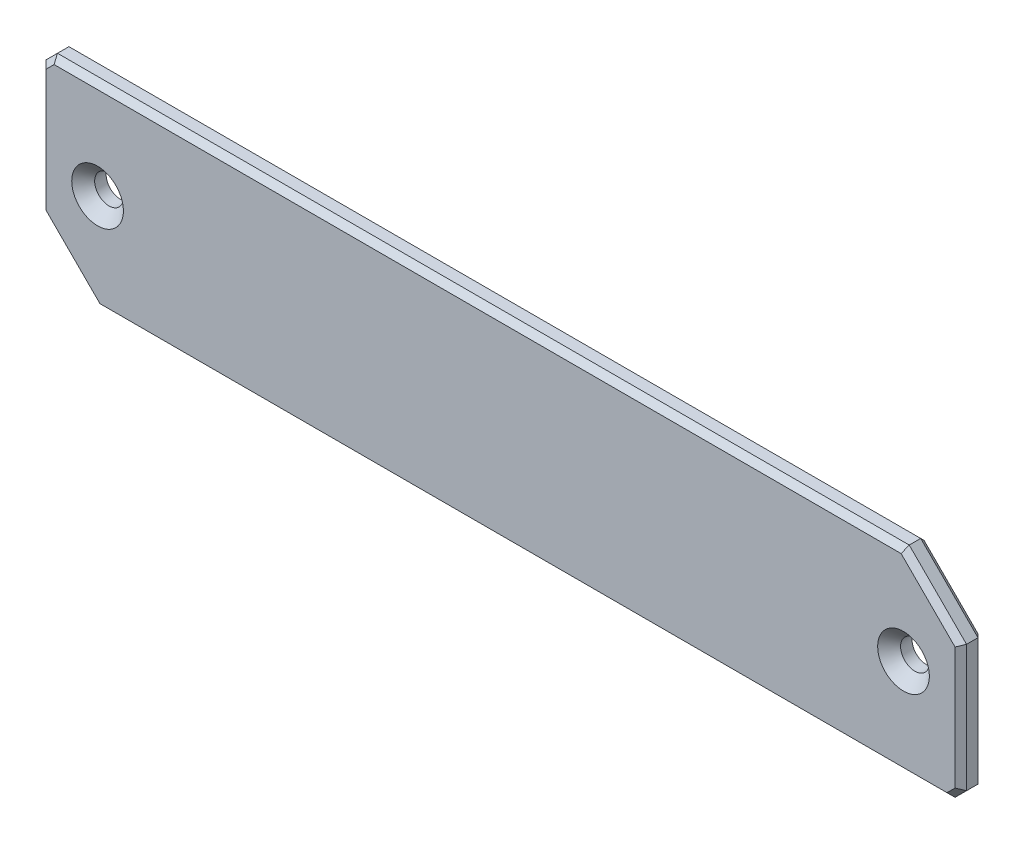
ISO-10303-21;
HEADER;
FILE_DESCRIPTION(('STEP AP214'),'2;1');
FILE_NAME('part.step','',(''),(''),'','','');
FILE_SCHEMA(('AUTOMOTIVE_DESIGN { 1 0 10303 214 1 1 1 1 }'));
ENDSEC;
DATA;
#1=APPLICATION_CONTEXT('core data for automotive mechanical design processes');
#2=APPLICATION_PROTOCOL_DEFINITION('international standard','automotive_design',2000,#1);
#3=PRODUCT_CONTEXT('',#1,'mechanical');
#4=PRODUCT('Part','Part','',(#3));
#5=PRODUCT_RELATED_PRODUCT_CATEGORY('part','',(#4));
#6=PRODUCT_DEFINITION_FORMATION('','',#4);
#7=PRODUCT_DEFINITION_CONTEXT('part definition',#1,'design');
#8=PRODUCT_DEFINITION('design','',#6,#7);
#9=PRODUCT_DEFINITION_SHAPE('','',#8);
#10=(LENGTH_UNIT() NAMED_UNIT(*) SI_UNIT(.MILLI.,.METRE.));
#11=(NAMED_UNIT(*) PLANE_ANGLE_UNIT() SI_UNIT($,.RADIAN.));
#12=(NAMED_UNIT(*) SI_UNIT($,.STERADIAN.) SOLID_ANGLE_UNIT());
#13=UNCERTAINTY_MEASURE_WITH_UNIT(LENGTH_MEASURE(1.E-05),#10,'distance_accuracy_value','');
#14=(GEOMETRIC_REPRESENTATION_CONTEXT(3) GLOBAL_UNCERTAINTY_ASSIGNED_CONTEXT((#13)) GLOBAL_UNIT_ASSIGNED_CONTEXT((#10,
#11,#12)) REPRESENTATION_CONTEXT('',''));
#15=CARTESIAN_POINT('',(0.,0.,0.));
#16=DIRECTION('',(0.,0.,1.));
#17=DIRECTION('',(1.,0.,0.));
#18=AXIS2_PLACEMENT_3D('',#15,#16,#17);
#19=CARTESIAN_POINT('',(0.,0.,2.));
#20=DIRECTION('',(0.,0.,-1.));
#21=DIRECTION('',(-1.,0.,0.));
#22=AXIS2_PLACEMENT_3D('',#19,#20,#21);
#23=PLANE('',#22);
#24=DIRECTION('',(-1.,0.,0.));
#25=VECTOR('',#24,1.);
#26=CARTESIAN_POINT('',(0.,18.3844434779468,2.));
#27=LINE('',#26,#25);
#28=CARTESIAN_POINT('',(9.24716234936022,18.3844434779468,2.));
#29=VERTEX_POINT('',#28);
#30=CARTESIAN_POINT('',(-64.6527720981398,18.3844434779468,2.));
#31=VERTEX_POINT('',#30);
#32=EDGE_CURVE('E160',#29,#31,#27,.T.);
#33=ORIENTED_EDGE('',*,*,#32,.T.);
#34=DIRECTION('',(-0.707106781186548,-0.707106781186548,0.));
#35=VECTOR('',#34,1.);
#36=CARTESIAN_POINT('',(-41.5186077880433,41.5186077880433,2.));
#37=LINE('',#36,#35);
#38=CARTESIAN_POINT('',(-65.3598788793264,17.6773366967603,2.));
#39=VERTEX_POINT('',#38);
#40=EDGE_CURVE('E191',#31,#39,#37,.T.);
#41=ORIENTED_EDGE('',*,*,#40,.T.);
#42=DIRECTION('',(0.,-1.,0.));
#43=VECTOR('',#42,1.);
#44=CARTESIAN_POINT('',(-65.3598788793264,0.,2.));
#45=LINE('',#44,#43);
#46=CARTESIAN_POINT('',(-65.3598788793264,7.02479380703534,2.));
#47=VERTEX_POINT('',#46);
#48=EDGE_CURVE('E189',#39,#47,#45,.T.);
#49=ORIENTED_EDGE('',*,*,#48,.T.);
#50=DIRECTION('',(0.707106781186547,-0.707106781186548,0.));
#51=VECTOR('',#50,1.);
#52=CARTESIAN_POINT('',(-29.1675425361455,-29.1675425361455,2.));
#53=LINE('',#52,#51);
#54=CARTESIAN_POINT('',(-60.6527720981398,2.31768702584879,2.));
#55=VERTEX_POINT('',#54);
#56=EDGE_CURVE('E187',#47,#55,#53,.T.);
#57=ORIENTED_EDGE('',*,*,#56,.T.);
#58=DIRECTION('',(1.,0.,0.));
#59=VECTOR('',#58,1.);
#60=CARTESIAN_POINT('',(0.,2.31768702584879,2.));
#61=LINE('',#60,#59);
#62=CARTESIAN_POINT('',(13.2471623493602,2.31768702584879,2.));
#63=VERTEX_POINT('',#62);
#64=EDGE_CURVE('E185',#55,#63,#61,.T.);
#65=ORIENTED_EDGE('',*,*,#64,.T.);
#66=DIRECTION('',(0.707106781186547,0.707106781186548,0.));
#67=VECTOR('',#66,1.);
#68=CARTESIAN_POINT('',(5.46473766175571,-5.46473766175571,2.));
#69=LINE('',#68,#67);
#70=CARTESIAN_POINT('',(13.9542691305468,3.02479380703535,2.));
#71=VERTEX_POINT('',#70);
#72=EDGE_CURVE('E156',#63,#71,#69,.T.);
#73=ORIENTED_EDGE('',*,*,#72,.T.);
#74=DIRECTION('',(0.,1.,0.));
#75=VECTOR('',#74,1.);
#76=CARTESIAN_POINT('',(13.9542691305468,0.,2.));
#77=LINE('',#76,#75);
#78=CARTESIAN_POINT('',(13.9542691305468,13.6773366967603,2.));
#79=VERTEX_POINT('',#78);
#80=EDGE_CURVE('E149',#71,#79,#77,.T.);
#81=ORIENTED_EDGE('',*,*,#80,.T.);
#82=DIRECTION('',(-0.707106781186547,0.707106781186548,0.));
#83=VECTOR('',#82,1.);
#84=CARTESIAN_POINT('',(13.8158029136535,13.8158029136535,2.));
#85=LINE('',#84,#83);
#86=EDGE_CURVE('E153',#79,#29,#85,.T.);
#87=ORIENTED_EDGE('',*,*,#86,.T.);
#88=EDGE_LOOP('',(#33,#41,#49,#57,#65,#73,#81,#87));
#89=FACE_BOUND('',#88,.T.);
#90=CARTESIAN_POINT('',(9.45426913054676,10.3510652518978,2.));
#91=DIRECTION('',(0.,0.,-1.));
#92=DIRECTION('',(-1.,0.,0.));
#93=AXIS2_PLACEMENT_3D('',#90,#91,#92);
#94=CIRCLE('',#93,2.25490856265427);
#95=CARTESIAN_POINT('',(7.19936056789248,10.3510652518978,2.));
#96=VERTEX_POINT('',#95);
#97=EDGE_CURVE('E180',#96,#96,#94,.T.);
#98=ORIENTED_EDGE('',*,*,#97,.T.);
#99=EDGE_LOOP('',(#98));
#100=FACE_BOUND('',#99,.T.);
#101=CARTESIAN_POINT('',(-60.8598788793264,10.3510652518978,2.));
#102=DIRECTION('',(0.,0.,-1.));
#103=DIRECTION('',(-1.,0.,0.));
#104=AXIS2_PLACEMENT_3D('',#101,#102,#103);
#105=CIRCLE('',#104,2.25490856265426);
#106=CARTESIAN_POINT('',(-63.1147874419806,10.3510652518978,2.));
#107=VERTEX_POINT('',#106);
#108=EDGE_CURVE('E336',#107,#107,#105,.T.);
#109=ORIENTED_EDGE('',*,*,#108,.T.);
#110=EDGE_LOOP('',(#109));
#111=FACE_BOUND('',#110,.T.);
#112=ADVANCED_FACE('F35',(#89,#100,#111),#23,.F.);
#113=CARTESIAN_POINT('',(0.,0.,0.));
#114=DIRECTION('',(0.,0.,-1.));
#115=DIRECTION('',(-1.,0.,0.));
#116=AXIS2_PLACEMENT_3D('',#113,#114,#115);
#117=PLANE('',#116);
#118=DIRECTION('',(1.,0.,0.));
#119=VECTOR('',#118,1.);
#120=CARTESIAN_POINT('',(9.45426913054676,18.3844434779468,0.));
#121=LINE('',#120,#119);
#122=CARTESIAN_POINT('',(-64.6527720981398,18.3844434779468,0.));
#123=VERTEX_POINT('',#122);
#124=CARTESIAN_POINT('',(9.24716234936022,18.3844434779468,0.));
#125=VERTEX_POINT('',#124);
#126=EDGE_CURVE('E228',#123,#125,#121,.T.);
#127=ORIENTED_EDGE('',*,*,#126,.T.);
#128=DIRECTION('',(0.707106781186547,-0.707106781186548,0.));
#129=VECTOR('',#128,1.);
#130=CARTESIAN_POINT('',(14.1007157399535,13.5308900873536,0.));
#131=LINE('',#130,#129);
#132=CARTESIAN_POINT('',(13.9542691305468,13.6773366967603,0.));
#133=VERTEX_POINT('',#132);
#134=EDGE_CURVE('E242',#125,#133,#131,.T.);
#135=ORIENTED_EDGE('',*,*,#134,.T.);
#136=DIRECTION('',(0.,-1.,0.));
#137=VECTOR('',#136,1.);
#138=CARTESIAN_POINT('',(13.9542691305468,2.8176870258488,0.));
#139=LINE('',#138,#137);
#140=CARTESIAN_POINT('',(13.9542691305468,3.02479380703534,0.));
#141=VERTEX_POINT('',#140);
#142=EDGE_CURVE('E240',#133,#141,#139,.T.);
#143=ORIENTED_EDGE('',*,*,#142,.T.);
#144=DIRECTION('',(-0.707106781186547,-0.707106781186548,0.));
#145=VECTOR('',#144,1.);
#146=CARTESIAN_POINT('',(13.1007157399535,2.17124041644207,0.));
#147=LINE('',#146,#145);
#148=CARTESIAN_POINT('',(13.2471623493602,2.31768702584879,0.));
#149=VERTEX_POINT('',#148);
#150=EDGE_CURVE('E238',#141,#149,#147,.T.);
#151=ORIENTED_EDGE('',*,*,#150,.T.);
#152=DIRECTION('',(-1.,0.,0.));
#153=VECTOR('',#152,1.);
#154=CARTESIAN_POINT('',(-60.8598788793264,2.31768702584879,0.));
#155=LINE('',#154,#153);
#156=CARTESIAN_POINT('',(-60.6527720981398,2.31768702584879,0.));
#157=VERTEX_POINT('',#156);
#158=EDGE_CURVE('E236',#149,#157,#155,.T.);
#159=ORIENTED_EDGE('',*,*,#158,.T.);
#160=DIRECTION('',(-0.707106781186547,0.707106781186548,0.));
#161=VECTOR('',#160,1.);
#162=CARTESIAN_POINT('',(-65.5063254887331,7.17124041644207,0.));
#163=LINE('',#162,#161);
#164=CARTESIAN_POINT('',(-65.3598788793264,7.02479380703536,0.));
#165=VERTEX_POINT('',#164);
#166=EDGE_CURVE('E234',#157,#165,#163,.T.);
#167=ORIENTED_EDGE('',*,*,#166,.T.);
#168=DIRECTION('',(0.,1.,0.));
#169=VECTOR('',#168,1.);
#170=CARTESIAN_POINT('',(-65.3598788793264,17.8844434779468,0.));
#171=LINE('',#170,#169);
#172=CARTESIAN_POINT('',(-65.3598788793264,17.6773366967603,0.));
#173=VERTEX_POINT('',#172);
#174=EDGE_CURVE('E232',#165,#173,#171,.T.);
#175=ORIENTED_EDGE('',*,*,#174,.T.);
#176=DIRECTION('',(0.707106781186548,0.707106781186548,0.));
#177=VECTOR('',#176,1.);
#178=CARTESIAN_POINT('',(-64.5063254887331,18.5308900873536,0.));
#179=LINE('',#178,#177);
#180=EDGE_CURVE('E230',#173,#123,#179,.T.);
#181=ORIENTED_EDGE('',*,*,#180,.T.);
#182=EDGE_LOOP('',(#127,#135,#143,#151,#159,#167,#175,#181));
#183=FACE_BOUND('',#182,.T.);
#184=CARTESIAN_POINT('',(-60.8598788793264,10.3510652518978,0.));
#185=DIRECTION('',(0.,0.,1.));
#186=DIRECTION('',(1.,0.,0.));
#187=AXIS2_PLACEMENT_3D('',#184,#185,#186);
#188=CIRCLE('',#187,1.25490856265426);
#189=CARTESIAN_POINT('',(-59.6049703166721,10.3510652518978,0.));
#190=VERTEX_POINT('',#189);
#191=EDGE_CURVE('E317',#190,#190,#188,.T.);
#192=ORIENTED_EDGE('',*,*,#191,.T.);
#193=EDGE_LOOP('',(#192));
#194=FACE_BOUND('',#193,.T.);
#195=CARTESIAN_POINT('',(9.45426913054676,10.3510652518978,0.));
#196=DIRECTION('',(0.,0.,1.));
#197=DIRECTION('',(1.,0.,0.));
#198=AXIS2_PLACEMENT_3D('',#195,#196,#197);
#199=CIRCLE('',#198,1.25490856265427);
#200=CARTESIAN_POINT('',(10.709177693201,10.3510652518978,0.));
#201=VERTEX_POINT('',#200);
#202=EDGE_CURVE('E225',#201,#201,#199,.T.);
#203=ORIENTED_EDGE('',*,*,#202,.T.);
#204=EDGE_LOOP('',(#203));
#205=FACE_BOUND('',#204,.T.);
#206=ADVANCED_FACE('F288',(#183,#194,#205),#117,.T.);
#207=CARTESIAN_POINT('',(-64.8598788793264,18.8844434779468,2.));
#208=DIRECTION('',(0.,-1.,0.));
#209=DIRECTION('',(0.,0.,-1.));
#210=AXIS2_PLACEMENT_3D('',#207,#208,#209);
#211=PLANE('',#210);
#212=DIRECTION('',(0.,0.,-1.));
#213=VECTOR('',#212,1.);
#214=CARTESIAN_POINT('',(9.45426913054676,18.8844434779468,2.));
#215=LINE('',#214,#213);
#216=CARTESIAN_POINT('',(9.45426913054676,18.8844434779468,1.5));
#217=VERTEX_POINT('',#216);
#218=CARTESIAN_POINT('',(9.45426913054676,18.8844434779468,0.499999999999994));
#219=VERTEX_POINT('',#218);
#220=EDGE_CURVE('E313',#217,#219,#215,.T.);
#221=ORIENTED_EDGE('',*,*,#220,.T.);
#222=DIRECTION('',(-1.,0.,0.));
#223=VECTOR('',#222,1.);
#224=CARTESIAN_POINT('',(-64.8598788793264,18.8844434779468,0.499999999999994));
#225=LINE('',#224,#223);
#226=CARTESIAN_POINT('',(-64.8598788793264,18.8844434779468,0.499999999999994));
#227=VERTEX_POINT('',#226);
#228=EDGE_CURVE('E11',#219,#227,#225,.T.);
#229=ORIENTED_EDGE('',*,*,#228,.T.);
#230=DIRECTION('',(0.,0.,-1.));
#231=VECTOR('',#230,1.);
#232=CARTESIAN_POINT('',(-64.8598788793264,18.8844434779468,2.));
#233=LINE('',#232,#231);
#234=CARTESIAN_POINT('',(-64.8598788793264,18.8844434779468,1.5));
#235=VERTEX_POINT('',#234);
#236=EDGE_CURVE('E331',#235,#227,#233,.T.);
#237=ORIENTED_EDGE('',*,*,#236,.F.);
#238=DIRECTION('',(1.,0.,0.));
#239=VECTOR('',#238,1.);
#240=CARTESIAN_POINT('',(-64.8598788793264,18.8844434779468,1.5));
#241=LINE('',#240,#239);
#242=EDGE_CURVE('E206',#235,#217,#241,.T.);
#243=ORIENTED_EDGE('',*,*,#242,.T.);
#244=EDGE_LOOP('',(#221,#229,#237,#243));
#245=FACE_BOUND('',#244,.T.);
#246=ADVANCED_FACE('F373',(#245),#211,.F.);
#247=CARTESIAN_POINT('',(-65.8598788793264,17.8844434779468,2.));
#248=DIRECTION('',(0.707106781186547,-0.707106781186547,0.));
#249=DIRECTION('',(0.707106781186548,0.707106781186548,0.));
#250=AXIS2_PLACEMENT_3D('',#247,#248,#249);
#251=PLANE('',#250);
#252=ORIENTED_EDGE('',*,*,#236,.T.);
#253=DIRECTION('',(-0.707106781186548,-0.707106781186548,0.));
#254=VECTOR('',#253,1.);
#255=CARTESIAN_POINT('',(-65.8598788793264,17.8844434779468,0.499999999999993));
#256=LINE('',#255,#254);
#257=CARTESIAN_POINT('',(-65.8598788793264,17.8844434779468,0.499999999999994));
#258=VERTEX_POINT('',#257);
#259=EDGE_CURVE('E44',#227,#258,#256,.T.);
#260=ORIENTED_EDGE('',*,*,#259,.T.);
#261=DIRECTION('',(0.,0.,-1.));
#262=VECTOR('',#261,1.);
#263=CARTESIAN_POINT('',(-65.8598788793264,17.8844434779468,2.));
#264=LINE('',#263,#262);
#265=CARTESIAN_POINT('',(-65.8598788793264,17.8844434779468,1.5));
#266=VERTEX_POINT('',#265);
#267=EDGE_CURVE('E329',#266,#258,#264,.T.);
#268=ORIENTED_EDGE('',*,*,#267,.F.);
#269=DIRECTION('',(0.707106781186548,0.707106781186548,0.));
#270=VECTOR('',#269,1.);
#271=CARTESIAN_POINT('',(-65.8598788793264,17.8844434779468,1.5));
#272=LINE('',#271,#270);
#273=EDGE_CURVE('E194',#266,#235,#272,.T.);
#274=ORIENTED_EDGE('',*,*,#273,.T.);
#275=EDGE_LOOP('',(#252,#260,#268,#274));
#276=FACE_BOUND('',#275,.T.);
#277=ADVANCED_FACE('F393',(#276),#251,.F.);
#278=CARTESIAN_POINT('',(-65.8598788793264,17.8844434779468,2.));
#279=DIRECTION('',(1.,0.,0.));
#280=DIRECTION('',(0.,0.,-1.));
#281=AXIS2_PLACEMENT_3D('',#278,#279,#280);
#282=PLANE('',#281);
#283=ORIENTED_EDGE('',*,*,#267,.T.);
#284=DIRECTION('',(0.,-1.,0.));
#285=VECTOR('',#284,1.);
#286=CARTESIAN_POINT('',(-65.8598788793264,6.8176870258488,0.499999999999994));
#287=LINE('',#286,#285);
#288=CARTESIAN_POINT('',(-65.8598788793264,6.8176870258488,0.499999999999994));
#289=VERTEX_POINT('',#288);
#290=EDGE_CURVE('E253',#258,#289,#287,.T.);
#291=ORIENTED_EDGE('',*,*,#290,.T.);
#292=DIRECTION('',(0.,0.,-1.));
#293=VECTOR('',#292,1.);
#294=CARTESIAN_POINT('',(-65.8598788793264,6.8176870258488,2.));
#295=LINE('',#294,#293);
#296=CARTESIAN_POINT('',(-65.8598788793264,6.8176870258488,1.49999999999999));
#297=VERTEX_POINT('',#296);
#298=EDGE_CURVE('E326',#297,#289,#295,.T.);
#299=ORIENTED_EDGE('',*,*,#298,.F.);
#300=DIRECTION('',(0.,1.,0.));
#301=VECTOR('',#300,1.);
#302=CARTESIAN_POINT('',(-65.8598788793264,17.8844434779468,1.5));
#303=LINE('',#302,#301);
#304=EDGE_CURVE('E197',#297,#266,#303,.T.);
#305=ORIENTED_EDGE('',*,*,#304,.T.);
#306=EDGE_LOOP('',(#283,#291,#299,#305));
#307=FACE_BOUND('',#306,.T.);
#308=ADVANCED_FACE('F389',(#307),#282,.F.);
#309=CARTESIAN_POINT('',(-65.8598788793264,6.8176870258488,2.));
#310=DIRECTION('',(0.707106781186548,0.707106781186547,0.));
#311=DIRECTION('',(-0.707106781186547,0.707106781186548,0.));
#312=AXIS2_PLACEMENT_3D('',#309,#310,#311);
#313=PLANE('',#312);
#314=ORIENTED_EDGE('',*,*,#298,.T.);
#315=DIRECTION('',(0.707106781186547,-0.707106781186548,0.));
#316=VECTOR('',#315,1.);
#317=CARTESIAN_POINT('',(-60.8598788793264,1.8176870258488,0.499999999999994));
#318=LINE('',#317,#316);
#319=CARTESIAN_POINT('',(-60.8598788793264,1.8176870258488,0.499999999999994));
#320=VERTEX_POINT('',#319);
#321=EDGE_CURVE('E251',#289,#320,#318,.T.);
#322=ORIENTED_EDGE('',*,*,#321,.T.);
#323=DIRECTION('',(0.,0.,-1.));
#324=VECTOR('',#323,1.);
#325=CARTESIAN_POINT('',(-60.8598788793264,1.8176870258488,2.));
#326=LINE('',#325,#324);
#327=CARTESIAN_POINT('',(-60.8598788793264,1.8176870258488,1.5));
#328=VERTEX_POINT('',#327);
#329=EDGE_CURVE('E323',#328,#320,#326,.T.);
#330=ORIENTED_EDGE('',*,*,#329,.F.);
#331=DIRECTION('',(-0.707106781186547,0.707106781186548,0.));
#332=VECTOR('',#331,1.);
#333=CARTESIAN_POINT('',(-65.8598788793264,6.8176870258488,1.49999999999999));
#334=LINE('',#333,#332);
#335=EDGE_CURVE('E199',#328,#297,#334,.T.);
#336=ORIENTED_EDGE('',*,*,#335,.T.);
#337=EDGE_LOOP('',(#314,#322,#330,#336));
#338=FACE_BOUND('',#337,.T.);
#339=ADVANCED_FACE('F385',(#338),#313,.F.);
#340=CARTESIAN_POINT('',(-60.8598788793264,1.8176870258488,2.));
#341=DIRECTION('',(0.,1.,0.));
#342=DIRECTION('',(0.,0.,1.));
#343=AXIS2_PLACEMENT_3D('',#340,#341,#342);
#344=PLANE('',#343);
#345=ORIENTED_EDGE('',*,*,#329,.T.);
#346=DIRECTION('',(1.,0.,0.));
#347=VECTOR('',#346,1.);
#348=CARTESIAN_POINT('',(13.4542691305468,1.8176870258488,0.499999999999994));
#349=LINE('',#348,#347);
#350=CARTESIAN_POINT('',(13.4542691305468,1.8176870258488,0.499999999999994));
#351=VERTEX_POINT('',#350);
#352=EDGE_CURVE('E249',#320,#351,#349,.T.);
#353=ORIENTED_EDGE('',*,*,#352,.T.);
#354=DIRECTION('',(0.,0.,-1.));
#355=VECTOR('',#354,1.);
#356=CARTESIAN_POINT('',(13.4542691305468,1.8176870258488,2.));
#357=LINE('',#356,#355);
#358=CARTESIAN_POINT('',(13.4542691305468,1.8176870258488,1.5));
#359=VERTEX_POINT('',#358);
#360=EDGE_CURVE('E315',#359,#351,#357,.T.);
#361=ORIENTED_EDGE('',*,*,#360,.F.);
#362=DIRECTION('',(-1.,0.,0.));
#363=VECTOR('',#362,1.);
#364=CARTESIAN_POINT('',(-60.8598788793264,1.8176870258488,1.5));
#365=LINE('',#364,#363);
#366=EDGE_CURVE('E201',#359,#328,#365,.T.);
#367=ORIENTED_EDGE('',*,*,#366,.T.);
#368=EDGE_LOOP('',(#345,#353,#361,#367));
#369=FACE_BOUND('',#368,.T.);
#370=ADVANCED_FACE('F381',(#369),#344,.F.);
#371=CARTESIAN_POINT('',(14.4542691305468,2.8176870258488,2.));
#372=DIRECTION('',(-0.707106781186548,0.707106781186547,0.));
#373=DIRECTION('',(-0.707106781186547,-0.707106781186548,0.));
#374=AXIS2_PLACEMENT_3D('',#371,#372,#373);
#375=PLANE('',#374);
#376=ORIENTED_EDGE('',*,*,#360,.T.);
#377=DIRECTION('',(0.707106781186547,0.707106781186548,0.));
#378=VECTOR('',#377,1.);
#379=CARTESIAN_POINT('',(14.4542691305468,2.8176870258488,0.499999999999994));
#380=LINE('',#379,#378);
#381=CARTESIAN_POINT('',(14.4542691305468,2.8176870258488,0.499999999999994));
#382=VERTEX_POINT('',#381);
#383=EDGE_CURVE('E247',#351,#382,#380,.T.);
#384=ORIENTED_EDGE('',*,*,#383,.T.);
#385=DIRECTION('',(0.,0.,-1.));
#386=VECTOR('',#385,1.);
#387=CARTESIAN_POINT('',(14.4542691305468,2.8176870258488,2.));
#388=LINE('',#387,#386);
#389=CARTESIAN_POINT('',(14.4542691305468,2.8176870258488,1.5));
#390=VERTEX_POINT('',#389);
#391=EDGE_CURVE('E309',#390,#382,#388,.T.);
#392=ORIENTED_EDGE('',*,*,#391,.F.);
#393=DIRECTION('',(-0.707106781186547,-0.707106781186548,0.));
#394=VECTOR('',#393,1.);
#395=CARTESIAN_POINT('',(14.4542691305468,2.8176870258488,1.5));
#396=LINE('',#395,#394);
#397=EDGE_CURVE('E203',#390,#359,#396,.T.);
#398=ORIENTED_EDGE('',*,*,#397,.T.);
#399=EDGE_LOOP('',(#376,#384,#392,#398));
#400=FACE_BOUND('',#399,.T.);
#401=ADVANCED_FACE('F378',(#400),#375,.F.);
#402=CARTESIAN_POINT('',(14.4542691305468,13.8844434779468,2.));
#403=DIRECTION('',(-1.,0.,0.));
#404=DIRECTION('',(0.,-1.,0.));
#405=AXIS2_PLACEMENT_3D('',#402,#403,#404);
#406=PLANE('',#405);
#407=ORIENTED_EDGE('',*,*,#391,.T.);
#408=DIRECTION('',(0.,1.,0.));
#409=VECTOR('',#408,1.);
#410=CARTESIAN_POINT('',(14.4542691305468,13.8844434779468,0.499999999999994));
#411=LINE('',#410,#409);
#412=CARTESIAN_POINT('',(14.4542691305468,13.8844434779468,0.499999999999994));
#413=VERTEX_POINT('',#412);
#414=EDGE_CURVE('E245',#382,#413,#411,.T.);
#415=ORIENTED_EDGE('',*,*,#414,.T.);
#416=DIRECTION('',(0.,0.,-1.));
#417=VECTOR('',#416,1.);
#418=CARTESIAN_POINT('',(14.4542691305468,13.8844434779468,2.));
#419=LINE('',#418,#417);
#420=CARTESIAN_POINT('',(14.4542691305468,13.8844434779468,1.5));
#421=VERTEX_POINT('',#420);
#422=EDGE_CURVE('E307',#421,#413,#419,.T.);
#423=ORIENTED_EDGE('',*,*,#422,.F.);
#424=DIRECTION('',(0.,-1.,0.));
#425=VECTOR('',#424,1.);
#426=CARTESIAN_POINT('',(14.4542691305468,13.8844434779468,1.5));
#427=LINE('',#426,#425);
#428=EDGE_CURVE('E166',#421,#390,#427,.T.);
#429=ORIENTED_EDGE('',*,*,#428,.T.);
#430=EDGE_LOOP('',(#407,#415,#423,#429));
#431=FACE_BOUND('',#430,.T.);
#432=ADVANCED_FACE('F306',(#431),#406,.F.);
#433=CARTESIAN_POINT('',(9.45426913054676,18.8844434779468,2.));
#434=DIRECTION('',(-0.707106781186548,-0.707106781186547,0.));
#435=DIRECTION('',(0.707106781186547,-0.707106781186548,0.));
#436=AXIS2_PLACEMENT_3D('',#433,#434,#435);
#437=PLANE('',#436);
#438=ORIENTED_EDGE('',*,*,#422,.T.);
#439=DIRECTION('',(-0.707106781186547,0.707106781186548,0.));
#440=VECTOR('',#439,1.);
#441=CARTESIAN_POINT('',(9.45426913054676,18.8844434779468,0.499999999999994));
#442=LINE('',#441,#440);
#443=EDGE_CURVE('E210',#413,#219,#442,.T.);
#444=ORIENTED_EDGE('',*,*,#443,.T.);
#445=ORIENTED_EDGE('',*,*,#220,.F.);
#446=DIRECTION('',(0.707106781186547,-0.707106781186548,0.));
#447=VECTOR('',#446,1.);
#448=CARTESIAN_POINT('',(9.45426913054676,18.8844434779468,1.5));
#449=LINE('',#448,#447);
#450=EDGE_CURVE('E208',#217,#421,#449,.T.);
#451=ORIENTED_EDGE('',*,*,#450,.T.);
#452=EDGE_LOOP('',(#438,#444,#445,#451));
#453=FACE_BOUND('',#452,.T.);
#454=ADVANCED_FACE('F311',(#453),#437,.F.);
#455=CARTESIAN_POINT('',(-60.8598788793264,10.3510652518978,2.));
#456=DIRECTION('',(0.,0.,-1.));
#457=DIRECTION('',(-1.,0.,0.));
#458=AXIS2_PLACEMENT_3D('',#455,#456,#457);
#459=CYLINDRICAL_SURFACE('',#458,1.25490856265426);
#460=CARTESIAN_POINT('',(-60.8598788793264,10.3510652518978,1.00000000000001));
#461=DIRECTION('',(0.,0.,-1.));
#462=DIRECTION('',(-1.,0.,0.));
#463=AXIS2_PLACEMENT_3D('',#460,#461,#462);
#464=CIRCLE('',#463,1.25490856265426);
#465=CARTESIAN_POINT('',(-62.1147874419806,10.3510652518978,1.00000000000001));
#466=VERTEX_POINT('',#465);
#467=EDGE_CURVE('E176',#466,#466,#464,.F.);
#468=ORIENTED_EDGE('',*,*,#467,.T.);
#469=EDGE_LOOP('',(#468));
#470=FACE_BOUND('',#469,.T.);
#471=ORIENTED_EDGE('',*,*,#191,.F.);
#472=EDGE_LOOP('',(#471));
#473=FACE_BOUND('',#472,.T.);
#474=ADVANCED_FACE('F352',(#470,#473),#459,.F.);
#475=CARTESIAN_POINT('',(9.45426913054676,10.3510652518978,2.));
#476=DIRECTION('',(0.,0.,-1.));
#477=DIRECTION('',(-1.,0.,0.));
#478=AXIS2_PLACEMENT_3D('',#475,#476,#477);
#479=CYLINDRICAL_SURFACE('',#478,1.25490856265427);
#480=CARTESIAN_POINT('',(9.45426913054676,10.3510652518978,1.));
#481=DIRECTION('',(0.,0.,-1.));
#482=DIRECTION('',(-1.,0.,0.));
#483=AXIS2_PLACEMENT_3D('',#480,#481,#482);
#484=CIRCLE('',#483,1.25490856265427);
#485=CARTESIAN_POINT('',(8.19936056789249,10.3510652518978,1.));
#486=VERTEX_POINT('',#485);
#487=EDGE_CURVE('E333',#486,#486,#484,.F.);
#488=ORIENTED_EDGE('',*,*,#487,.T.);
#489=EDGE_LOOP('',(#488));
#490=FACE_BOUND('',#489,.T.);
#491=ORIENTED_EDGE('',*,*,#202,.F.);
#492=EDGE_LOOP('',(#491));
#493=FACE_BOUND('',#492,.T.);
#494=ADVANCED_FACE('F346',(#490,#493),#479,.F.);
#495=CARTESIAN_POINT('',(9.45426913054676,10.3510652518978,1.));
#496=DIRECTION('',(0.,0.,1.));
#497=DIRECTION('',(1.,0.,0.));
#498=AXIS2_PLACEMENT_3D('',#495,#496,#497);
#499=CONICAL_SURFACE('',#498,1.25490856265427,0.785398163397449);
#500=ORIENTED_EDGE('',*,*,#97,.F.);
#501=EDGE_LOOP('',(#500));
#502=FACE_BOUND('',#501,.T.);
#503=ORIENTED_EDGE('',*,*,#487,.F.);
#504=EDGE_LOOP('',(#503));
#505=FACE_BOUND('',#504,.T.);
#506=ADVANCED_FACE('F342',(#502,#505),#499,.F.);
#507=CARTESIAN_POINT('',(-60.8598788793264,10.3510652518978,1.00000000000001));
#508=DIRECTION('',(0.,0.,1.));
#509=DIRECTION('',(1.,0.,0.));
#510=AXIS2_PLACEMENT_3D('',#507,#508,#509);
#511=CONICAL_SURFACE('',#510,1.25490856265426,0.78539816339745);
#512=ORIENTED_EDGE('',*,*,#108,.F.);
#513=EDGE_LOOP('',(#512));
#514=FACE_BOUND('',#513,.T.);
#515=ORIENTED_EDGE('',*,*,#467,.F.);
#516=EDGE_LOOP('',(#515));
#517=FACE_BOUND('',#516,.T.);
#518=ADVANCED_FACE('F345',(#514,#517),#511,.F.);
#519=CARTESIAN_POINT('',(5.46473766175571,-5.46473766175571,2.));
#520=DIRECTION('',(-0.500000000000002,0.500000000000002,-0.707106781186545));
#521=DIRECTION('',(0.707106781186547,0.707106781186548,0.));
#522=AXIS2_PLACEMENT_3D('',#519,#520,#521);
#523=PLANE('',#522);
#524=DIRECTION('',(0.281084637714822,-0.678598344545843,-0.678598344545851));
#525=VECTOR('',#524,1.);
#526=CARTESIAN_POINT('',(14.1167315428112,0.218361285597691,-0.0993257402511299));
#527=LINE('',#526,#525);
#528=EDGE_CURVE('E169',#359,#63,#527,.F.);
#529=ORIENTED_EDGE('',*,*,#528,.F.);
#530=ORIENTED_EDGE('',*,*,#397,.F.);
#531=DIRECTION('',(0.678598344545844,-0.281084637714819,-0.67859834454585));
#532=VECTOR('',#531,1.);
#533=CARTESIAN_POINT('',(14.531229099302,2.78580916303057,1.42304003124475));
#534=LINE('',#533,#532);
#535=EDGE_CURVE('E223',#71,#390,#534,.T.);
#536=ORIENTED_EDGE('',*,*,#535,.F.);
#537=ORIENTED_EDGE('',*,*,#72,.F.);
#538=EDGE_LOOP('',(#529,#530,#536,#537));
#539=FACE_BOUND('',#538,.T.);
#540=ADVANCED_FACE('F401',(#539),#523,.F.);
#541=CARTESIAN_POINT('',(13.9542691305468,0.,2.));
#542=DIRECTION('',(-0.707106781186551,0.,-0.707106781186544));
#543=DIRECTION('',(0.,1.,0.));
#544=AXIS2_PLACEMENT_3D('',#541,#542,#543);
#545=PLANE('',#544);
#546=ORIENTED_EDGE('',*,*,#535,.T.);
#547=ORIENTED_EDGE('',*,*,#428,.F.);
#548=DIRECTION('',(0.678598344545846,0.281084637714811,-0.678598344545852));
#549=VECTOR('',#548,1.);
#550=CARTESIAN_POINT('',(13.9169175717527,13.661865174532,2.03735155879403));
#551=LINE('',#550,#549);
#552=EDGE_CURVE('E164',#79,#421,#551,.T.);
#553=ORIENTED_EDGE('',*,*,#552,.F.);
#554=ORIENTED_EDGE('',*,*,#80,.F.);
#555=EDGE_LOOP('',(#546,#547,#553,#554));
#556=FACE_BOUND('',#555,.T.);
#557=ADVANCED_FACE('F165',(#556),#545,.F.);
#558=CARTESIAN_POINT('',(0.,2.31768702584879,2.));
#559=DIRECTION('',(0.,0.707106781186552,-0.707106781186543));
#560=DIRECTION('',(1.,0.,0.));
#561=AXIS2_PLACEMENT_3D('',#558,#559,#560);
#562=PLANE('',#561);
#563=ORIENTED_EDGE('',*,*,#528,.T.);
#564=ORIENTED_EDGE('',*,*,#64,.F.);
#565=DIRECTION('',(-0.281084637714823,-0.678598344545842,-0.67859834454585));
#566=VECTOR('',#565,1.);
#567=CARTESIAN_POINT('',(-55.8606830922501,13.8868132959666,13.5691262701179));
#568=LINE('',#567,#566);
#569=EDGE_CURVE('E170',#328,#55,#568,.F.);
#570=ORIENTED_EDGE('',*,*,#569,.F.);
#571=ORIENTED_EDGE('',*,*,#366,.F.);
#572=EDGE_LOOP('',(#563,#564,#570,#571));
#573=FACE_BOUND('',#572,.T.);
#574=ADVANCED_FACE('F421',(#573),#562,.F.);
#575=CARTESIAN_POINT('',(13.8158029136535,13.8158029136535,2.));
#576=DIRECTION('',(-0.500000000000005,-0.500000000000004,-0.707106781186541));
#577=DIRECTION('',(-0.707106781186547,0.707106781186548,0.));
#578=AXIS2_PLACEMENT_3D('',#575,#576,#577);
#579=PLANE('',#578);
#580=ORIENTED_EDGE('',*,*,#552,.T.);
#581=ORIENTED_EDGE('',*,*,#450,.F.);
#582=DIRECTION('',(-0.281084637714815,-0.678598344545844,0.678598344545853));
#583=VECTOR('',#582,1.);
#584=CARTESIAN_POINT('',(8.73668531294412,17.1520428933511,3.23240058459581));
#585=LINE('',#584,#583);
#586=EDGE_CURVE('E174',#29,#217,#585,.F.);
#587=ORIENTED_EDGE('',*,*,#586,.F.);
#588=ORIENTED_EDGE('',*,*,#86,.F.);
#589=EDGE_LOOP('',(#580,#581,#587,#588));
#590=FACE_BOUND('',#589,.T.);
#591=ADVANCED_FACE('F172',(#590),#579,.F.);
#592=CARTESIAN_POINT('',(-29.1675425361455,-29.1675425361455,2.));
#593=DIRECTION('',(0.500000000000002,0.500000000000002,-0.707106781186545));
#594=DIRECTION('',(0.707106781186547,-0.707106781186548,0.));
#595=AXIS2_PLACEMENT_3D('',#592,#593,#594);
#596=PLANE('',#595);
#597=ORIENTED_EDGE('',*,*,#569,.T.);
#598=ORIENTED_EDGE('',*,*,#56,.F.);
#599=DIRECTION('',(-0.678598344545848,-0.281084637714814,-0.678598344545848));
#600=VECTOR('',#599,1.);
#601=CARTESIAN_POINT('',(-55.5969185764679,11.0687443733894,11.7629603028584));
#602=LINE('',#601,#600);
#603=EDGE_CURVE('E215',#297,#47,#602,.F.);
#604=ORIENTED_EDGE('',*,*,#603,.F.);
#605=ORIENTED_EDGE('',*,*,#335,.F.);
#606=EDGE_LOOP('',(#597,#598,#604,#605));
#607=FACE_BOUND('',#606,.T.);
#608=ADVANCED_FACE('F414',(#607),#596,.F.);
#609=CARTESIAN_POINT('',(0.,18.3844434779468,2.));
#610=DIRECTION('',(0.,-0.707106781186552,-0.707106781186543));
#611=DIRECTION('',(-1.,0.,0.));
#612=AXIS2_PLACEMENT_3D('',#609,#610,#611);
#613=PLANE('',#612);
#614=ORIENTED_EDGE('',*,*,#586,.T.);
#615=ORIENTED_EDGE('',*,*,#242,.F.);
#616=DIRECTION('',(0.281084637714818,-0.678598344545843,0.678598344545852));
#617=VECTOR('',#616,1.);
#618=CARTESIAN_POINT('',(-59.5446487980132,6.05234292850709,14.3321005494399));
#619=LINE('',#618,#617);
#620=EDGE_CURVE('E213',#31,#235,#619,.F.);
#621=ORIENTED_EDGE('',*,*,#620,.F.);
#622=ORIENTED_EDGE('',*,*,#32,.F.);
#623=EDGE_LOOP('',(#614,#615,#621,#622));
#624=FACE_BOUND('',#623,.T.);
#625=ADVANCED_FACE('F410',(#624),#613,.F.);
#626=CARTESIAN_POINT('',(-65.3598788793264,0.,2.));
#627=DIRECTION('',(0.707106781186547,0.,-0.707106781186547));
#628=DIRECTION('',(0.,-1.,0.));
#629=AXIS2_PLACEMENT_3D('',#626,#627,#628);
#630=PLANE('',#629);
#631=ORIENTED_EDGE('',*,*,#603,.T.);
#632=ORIENTED_EDGE('',*,*,#48,.F.);
#633=DIRECTION('',(-0.67859834454585,0.281084637714808,-0.67859834454585));
#634=VECTOR('',#633,1.);
#635=CARTESIAN_POINT('',(-61.9880405726899,16.2806755400224,5.37183830663644));
#636=LINE('',#635,#634);
#637=EDGE_CURVE('E211',#266,#39,#636,.F.);
#638=ORIENTED_EDGE('',*,*,#637,.F.);
#639=ORIENTED_EDGE('',*,*,#304,.F.);
#640=EDGE_LOOP('',(#631,#632,#638,#639));
#641=FACE_BOUND('',#640,.T.);
#642=ADVANCED_FACE('F406',(#641),#630,.F.);
#643=CARTESIAN_POINT('',(-41.5186077880433,41.5186077880433,2.));
#644=DIRECTION('',(0.500000000000003,-0.500000000000003,-0.707106781186543));
#645=DIRECTION('',(-0.707106781186548,-0.707106781186548,0.));
#646=AXIS2_PLACEMENT_3D('',#643,#644,#645);
#647=PLANE('',#646);
#648=ORIENTED_EDGE('',*,*,#620,.T.);
#649=ORIENTED_EDGE('',*,*,#273,.F.);
#650=ORIENTED_EDGE('',*,*,#637,.T.);
#651=ORIENTED_EDGE('',*,*,#40,.F.);
#652=EDGE_LOOP('',(#648,#649,#650,#651));
#653=FACE_BOUND('',#652,.T.);
#654=ADVANCED_FACE('F403',(#653),#647,.F.);
#655=CARTESIAN_POINT('',(-65.8598788793264,6.8176870258488,0.499999999999994));
#656=DIRECTION('',(-0.499999999999998,-0.499999999999998,-0.70710678118655));
#657=DIRECTION('',(-0.707106781186547,0.707106781186548,0.));
#658=AXIS2_PLACEMENT_3D('',#655,#656,#657);
#659=PLANE('',#658);
#660=DIRECTION('',(-0.678598344545839,-0.281084637714837,0.678598344545848));
#661=VECTOR('',#660,1.);
#662=CARTESIAN_POINT('',(-63.7489662472079,7.69205566705704,-1.61091263211854));
#663=LINE('',#662,#661);
#664=EDGE_CURVE('E271',#165,#289,#663,.T.);
#665=ORIENTED_EDGE('',*,*,#664,.F.);
#666=ORIENTED_EDGE('',*,*,#166,.F.);
#667=DIRECTION('',(-0.281084637714827,-0.678598344545846,0.678598344545846));
#668=VECTOR('',#667,1.);
#669=CARTESIAN_POINT('',(-60.30120389797,3.16644774279786,-0.848760716949069));
#670=LINE('',#669,#668);
#671=EDGE_CURVE('E39',#320,#157,#670,.F.);
#672=ORIENTED_EDGE('',*,*,#671,.F.);
#673=ORIENTED_EDGE('',*,*,#321,.F.);
#674=EDGE_LOOP('',(#665,#666,#672,#673));
#675=FACE_BOUND('',#674,.T.);
#676=ADVANCED_FACE('F37',(#675),#659,.T.);
#677=CARTESIAN_POINT('',(-60.8598788793264,1.8176870258488,0.499999999999994));
#678=DIRECTION('',(0.,-0.707106781186547,-0.707106781186547));
#679=DIRECTION('',(-1.,0.,0.));
#680=AXIS2_PLACEMENT_3D('',#677,#678,#679);
#681=PLANE('',#680);
#682=ORIENTED_EDGE('',*,*,#671,.T.);
#683=ORIENTED_EDGE('',*,*,#158,.F.);
#684=DIRECTION('',(0.281084637714816,-0.678598344545848,0.678598344545848));
#685=VECTOR('',#684,1.);
#686=CARTESIAN_POINT('',(7.58281430101427,15.9926329061674,-13.6749458803186));
#687=LINE('',#686,#685);
#688=EDGE_CURVE('E269',#351,#149,#687,.F.);
#689=ORIENTED_EDGE('',*,*,#688,.F.);
#690=ORIENTED_EDGE('',*,*,#352,.F.);
#691=EDGE_LOOP('',(#682,#683,#689,#690));
#692=FACE_BOUND('',#691,.T.);
#693=ADVANCED_FACE('F282',(#692),#681,.T.);
#694=CARTESIAN_POINT('',(-65.8598788793264,17.8844434779468,0.499999999999994));
#695=DIRECTION('',(-0.707106781186552,0.,-0.707106781186543));
#696=DIRECTION('',(0.,1.,0.));
#697=AXIS2_PLACEMENT_3D('',#694,#695,#696);
#698=PLANE('',#697);
#699=ORIENTED_EDGE('',*,*,#664,.T.);
#700=ORIENTED_EDGE('',*,*,#290,.F.);
#701=DIRECTION('',(-0.67859834454584,0.281084637714831,0.678598344545849));
#702=VECTOR('',#701,1.);
#703=CARTESIAN_POINT('',(-65.8598788793264,17.8844434779468,0.499999999999994));
#704=LINE('',#703,#702);
#705=EDGE_CURVE('E266',#173,#258,#704,.T.);
#706=ORIENTED_EDGE('',*,*,#705,.F.);
#707=ORIENTED_EDGE('',*,*,#174,.F.);
#708=EDGE_LOOP('',(#699,#700,#706,#707));
#709=FACE_BOUND('',#708,.T.);
#710=ADVANCED_FACE('F446',(#709),#698,.T.);
#711=CARTESIAN_POINT('',(14.4542691305468,2.8176870258488,0.499999999999994));
#712=DIRECTION('',(0.500000000000002,-0.500000000000001,-0.707106781186546));
#713=DIRECTION('',(-0.707106781186547,-0.707106781186548,0.));
#714=AXIS2_PLACEMENT_3D('',#711,#712,#713);
#715=PLANE('',#714);
#716=ORIENTED_EDGE('',*,*,#688,.T.);
#717=ORIENTED_EDGE('',*,*,#150,.F.);
#718=DIRECTION('',(0.678598344545849,-0.281084637714814,0.678598344545848));
#719=VECTOR('',#718,1.);
#720=CARTESIAN_POINT('',(14.4542691305468,2.8176870258488,0.499999999999994));
#721=LINE('',#720,#719);
#722=EDGE_CURVE('E263',#382,#141,#721,.F.);
#723=ORIENTED_EDGE('',*,*,#722,.F.);
#724=ORIENTED_EDGE('',*,*,#383,.F.);
#725=EDGE_LOOP('',(#716,#717,#723,#724));
#726=FACE_BOUND('',#725,.T.);
#727=ADVANCED_FACE('F295',(#726),#715,.T.);
#728=CARTESIAN_POINT('',(-65.8598788793264,17.8844434779468,0.499999999999994));
#729=DIRECTION('',(-0.5,0.5,-0.707106781186547));
#730=DIRECTION('',(0.707106781186548,0.707106781186548,0.));
#731=AXIS2_PLACEMENT_3D('',#728,#729,#730);
#732=PLANE('',#731);
#733=ORIENTED_EDGE('',*,*,#705,.T.);
#734=ORIENTED_EDGE('',*,*,#259,.F.);
#735=DIRECTION('',(-0.28108463771482,0.678598344545847,0.678598344545847));
#736=VECTOR('',#735,1.);
#737=CARTESIAN_POINT('',(-64.8598788793264,18.8844434779468,0.499999999999994));
#738=LINE('',#737,#736);
#739=EDGE_CURVE('E260',#123,#227,#738,.T.);
#740=ORIENTED_EDGE('',*,*,#739,.F.);
#741=ORIENTED_EDGE('',*,*,#180,.F.);
#742=EDGE_LOOP('',(#733,#734,#740,#741));
#743=FACE_BOUND('',#742,.T.);
#744=ADVANCED_FACE('F440',(#743),#732,.T.);
#745=CARTESIAN_POINT('',(14.4542691305468,13.8844434779468,0.499999999999994));
#746=DIRECTION('',(0.707106781186547,0.,-0.707106781186548));
#747=DIRECTION('',(0.,-1.,0.));
#748=AXIS2_PLACEMENT_3D('',#745,#746,#747);
#749=PLANE('',#748);
#750=ORIENTED_EDGE('',*,*,#722,.T.);
#751=ORIENTED_EDGE('',*,*,#142,.F.);
#752=DIRECTION('',(0.678598344545849,0.281084637714815,0.678598344545848));
#753=VECTOR('',#752,1.);
#754=CARTESIAN_POINT('',(14.4542691305468,13.8844434779468,0.499999999999993));
#755=LINE('',#754,#753);
#756=EDGE_CURVE('E258',#413,#133,#755,.F.);
#757=ORIENTED_EDGE('',*,*,#756,.F.);
#758=ORIENTED_EDGE('',*,*,#414,.F.);
#759=EDGE_LOOP('',(#750,#751,#757,#758));
#760=FACE_BOUND('',#759,.T.);
#761=ADVANCED_FACE('F299',(#760),#749,.T.);
#762=CARTESIAN_POINT('',(-64.8598788793264,18.8844434779468,0.499999999999994));
#763=DIRECTION('',(0.,0.707106781186547,-0.707106781186547));
#764=DIRECTION('',(1.,0.,0.));
#765=AXIS2_PLACEMENT_3D('',#762,#763,#764);
#766=PLANE('',#765);
#767=ORIENTED_EDGE('',*,*,#739,.T.);
#768=ORIENTED_EDGE('',*,*,#228,.F.);
#769=DIRECTION('',(-0.281084637714816,-0.678598344545848,-0.678598344545848));
#770=VECTOR('',#769,1.);
#771=CARTESIAN_POINT('',(3.58281430101426,4.70949759762824,-13.6749458803186));
#772=LINE('',#771,#770);
#773=EDGE_CURVE('E256',#125,#219,#772,.F.);
#774=ORIENTED_EDGE('',*,*,#773,.F.);
#775=ORIENTED_EDGE('',*,*,#126,.F.);
#776=EDGE_LOOP('',(#767,#768,#774,#775));
#777=FACE_BOUND('',#776,.T.);
#778=ADVANCED_FACE('F433',(#777),#766,.T.);
#779=CARTESIAN_POINT('',(9.45426913054676,18.8844434779468,0.499999999999994));
#780=DIRECTION('',(0.500000000000001,0.500000000000001,-0.707106781186546));
#781=DIRECTION('',(0.707106781186547,-0.707106781186548,0.));
#782=AXIS2_PLACEMENT_3D('',#779,#780,#781);
#783=PLANE('',#782);
#784=ORIENTED_EDGE('',*,*,#756,.T.);
#785=ORIENTED_EDGE('',*,*,#134,.F.);
#786=ORIENTED_EDGE('',*,*,#773,.T.);
#787=ORIENTED_EDGE('',*,*,#443,.F.);
#788=EDGE_LOOP('',(#784,#785,#786,#787));
#789=FACE_BOUND('',#788,.T.);
#790=ADVANCED_FACE('F430',(#789),#783,.T.);
#791=CLOSED_SHELL('',(#112,#206,#246,#277,#308,#339,#370,#401,#432,#454,#474,#494,#506,#518,
#540,#557,#574,#591,#608,#625,#642,#654,#676,#693,#710,#727,#744,#761,#778,#790));
#792=MANIFOLD_SOLID_BREP('B2',#791);
#793=ADVANCED_BREP_SHAPE_REPRESENTATION('',(#18,#792),#14);
#794=SHAPE_DEFINITION_REPRESENTATION(#9,#793);
ENDSEC;
END-ISO-10303-21;
